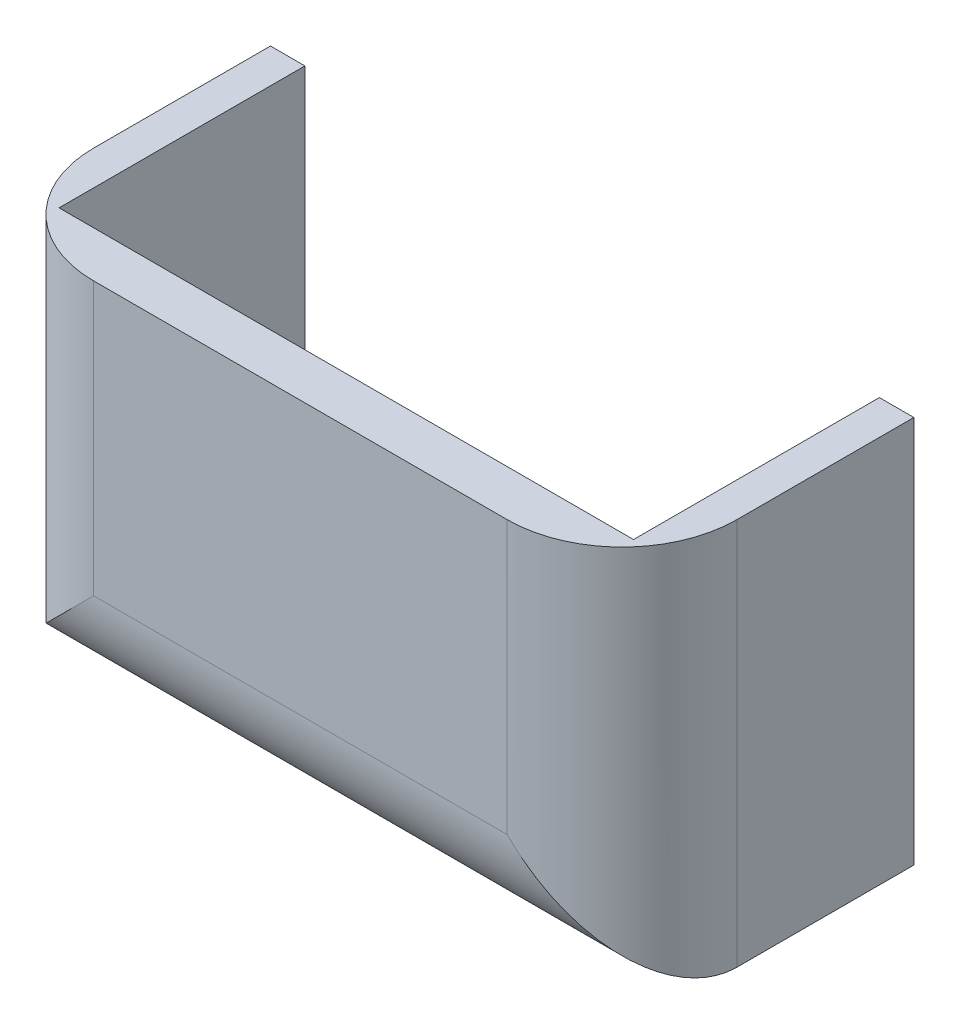
ISO-10303-21;
HEADER;
FILE_DESCRIPTION(('STEP AP214'),'2;1');
FILE_NAME('part.step','',(''),(''),'','','');
FILE_SCHEMA(('AUTOMOTIVE_DESIGN { 1 0 10303 214 1 1 1 1 }'));
ENDSEC;
DATA;
#1=APPLICATION_CONTEXT('core data for automotive mechanical design processes');
#2=APPLICATION_PROTOCOL_DEFINITION('international standard','automotive_design',2000,#1);
#3=PRODUCT_CONTEXT('',#1,'mechanical');
#4=PRODUCT('Part','Part','',(#3));
#5=PRODUCT_RELATED_PRODUCT_CATEGORY('part','',(#4));
#6=PRODUCT_DEFINITION_FORMATION('','',#4);
#7=PRODUCT_DEFINITION_CONTEXT('part definition',#1,'design');
#8=PRODUCT_DEFINITION('design','',#6,#7);
#9=PRODUCT_DEFINITION_SHAPE('','',#8);
#10=(LENGTH_UNIT() NAMED_UNIT(*) SI_UNIT(.MILLI.,.METRE.));
#11=(NAMED_UNIT(*) PLANE_ANGLE_UNIT() SI_UNIT($,.RADIAN.));
#12=(NAMED_UNIT(*) SI_UNIT($,.STERADIAN.) SOLID_ANGLE_UNIT());
#13=UNCERTAINTY_MEASURE_WITH_UNIT(LENGTH_MEASURE(1.E-05),#10,'distance_accuracy_value','');
#14=(GEOMETRIC_REPRESENTATION_CONTEXT(3) GLOBAL_UNCERTAINTY_ASSIGNED_CONTEXT((#13)) GLOBAL_UNIT_ASSIGNED_CONTEXT((#10,
#11,#12)) REPRESENTATION_CONTEXT('',''));
#15=CARTESIAN_POINT('',(0.,0.,0.));
#16=DIRECTION('',(0.,0.,1.));
#17=DIRECTION('',(1.,0.,0.));
#18=AXIS2_PLACEMENT_3D('',#15,#16,#17);
#19=CARTESIAN_POINT('',(-25.,-36.0430371293911,25.4));
#20=DIRECTION('',(1.,0.,0.));
#21=DIRECTION('',(0.,1.,0.));
#22=AXIS2_PLACEMENT_3D('',#19,#20,#21);
#23=PLANE('',#22);
#24=DIRECTION('',(0.,0.,-1.));
#25=VECTOR('',#24,1.);
#26=CARTESIAN_POINT('',(-25.,-36.0430371293911,25.4));
#27=LINE('',#26,#25);
#28=CARTESIAN_POINT('',(-25.,-36.0430371293911,21.4));
#29=VERTEX_POINT('',#28);
#30=CARTESIAN_POINT('',(-25.,-36.0430371293911,0.));
#31=VERTEX_POINT('',#30);
#32=EDGE_CURVE('E216',#29,#31,#27,.T.);
#33=ORIENTED_EDGE('',*,*,#32,.F.);
#34=DIRECTION('',(0.,-1.,0.));
#35=VECTOR('',#34,1.);
#36=CARTESIAN_POINT('',(-25.,-36.0430371293911,21.4));
#37=LINE('',#36,#35);
#38=CARTESIAN_POINT('',(-25.,-66.782740738817,21.4));
#39=VERTEX_POINT('',#38);
#40=EDGE_CURVE('E199',#29,#39,#37,.T.);
#41=ORIENTED_EDGE('',*,*,#40,.T.);
#42=DIRECTION('',(0.,0.,-1.));
#43=VECTOR('',#42,1.);
#44=CARTESIAN_POINT('',(-25.,-66.782740738817,25.4));
#45=LINE('',#44,#43);
#46=CARTESIAN_POINT('',(-25.,-66.782740738817,0.));
#47=VERTEX_POINT('',#46);
#48=EDGE_CURVE('E225',#39,#47,#45,.T.);
#49=ORIENTED_EDGE('',*,*,#48,.T.);
#50=DIRECTION('',(0.,-1.,0.));
#51=VECTOR('',#50,1.);
#52=CARTESIAN_POINT('',(-25.,-36.0430371293911,0.));
#53=LINE('',#52,#51);
#54=EDGE_CURVE('E207',#31,#47,#53,.T.);
#55=ORIENTED_EDGE('',*,*,#54,.F.);
#56=EDGE_LOOP('',(#33,#41,#49,#55));
#57=FACE_BOUND('',#56,.T.);
#58=ADVANCED_FACE('F44',(#57),#23,.T.);
#59=CARTESIAN_POINT('',(-25.,-66.782740738817,25.4));
#60=DIRECTION('',(0.,1.,0.));
#61=DIRECTION('',(0.,0.,1.));
#62=AXIS2_PLACEMENT_3D('',#59,#60,#61);
#63=PLANE('',#62);
#64=ORIENTED_EDGE('',*,*,#48,.F.);
#65=DIRECTION('',(1.,0.,0.));
#66=VECTOR('',#65,1.);
#67=CARTESIAN_POINT('',(-25.,-66.782740738817,21.4));
#68=LINE('',#67,#66);
#69=CARTESIAN_POINT('',(25.,-66.782740738817,21.4));
#70=VERTEX_POINT('',#69);
#71=EDGE_CURVE('E193',#39,#70,#68,.T.);
#72=ORIENTED_EDGE('',*,*,#71,.T.);
#73=DIRECTION('',(0.,0.,-1.));
#74=VECTOR('',#73,1.);
#75=CARTESIAN_POINT('',(25.,-66.782740738817,25.4));
#76=LINE('',#75,#74);
#77=CARTESIAN_POINT('',(25.,-66.782740738817,0.));
#78=VERTEX_POINT('',#77);
#79=EDGE_CURVE('E222',#70,#78,#76,.T.);
#80=ORIENTED_EDGE('',*,*,#79,.T.);
#81=DIRECTION('',(1.,0.,0.));
#82=VECTOR('',#81,1.);
#83=CARTESIAN_POINT('',(-25.,-66.782740738817,0.));
#84=LINE('',#83,#82);
#85=EDGE_CURVE('E211',#47,#78,#84,.T.);
#86=ORIENTED_EDGE('',*,*,#85,.F.);
#87=EDGE_LOOP('',(#64,#72,#80,#86));
#88=FACE_BOUND('',#87,.T.);
#89=ADVANCED_FACE('F257',(#88),#63,.T.);
#90=CARTESIAN_POINT('',(25.,-36.0430371293911,25.4));
#91=DIRECTION('',(-1.,0.,0.));
#92=DIRECTION('',(0.,-1.,0.));
#93=AXIS2_PLACEMENT_3D('',#90,#91,#92);
#94=PLANE('',#93);
#95=ORIENTED_EDGE('',*,*,#79,.F.);
#96=DIRECTION('',(0.,1.,0.));
#97=VECTOR('',#96,1.);
#98=CARTESIAN_POINT('',(25.,-36.0430371293911,21.4));
#99=LINE('',#98,#97);
#100=CARTESIAN_POINT('',(25.,-36.0430371293911,21.4));
#101=VERTEX_POINT('',#100);
#102=EDGE_CURVE('E186',#70,#101,#99,.T.);
#103=ORIENTED_EDGE('',*,*,#102,.T.);
#104=DIRECTION('',(0.,0.,-1.));
#105=VECTOR('',#104,1.);
#106=CARTESIAN_POINT('',(25.,-36.0430371293911,25.4));
#107=LINE('',#106,#105);
#108=CARTESIAN_POINT('',(25.,-36.0430371293911,0.));
#109=VERTEX_POINT('',#108);
#110=EDGE_CURVE('E219',#101,#109,#107,.T.);
#111=ORIENTED_EDGE('',*,*,#110,.T.);
#112=DIRECTION('',(0.,1.,0.));
#113=VECTOR('',#112,1.);
#114=CARTESIAN_POINT('',(25.,-36.0430371293911,0.));
#115=LINE('',#114,#113);
#116=EDGE_CURVE('E138',#78,#109,#115,.T.);
#117=ORIENTED_EDGE('',*,*,#116,.F.);
#118=EDGE_LOOP('',(#95,#103,#111,#117));
#119=FACE_BOUND('',#118,.T.);
#120=ADVANCED_FACE('F258',(#119),#94,.T.);
#121=CARTESIAN_POINT('',(0.,0.,25.4));
#122=DIRECTION('',(0.,0.,1.));
#123=DIRECTION('',(1.,0.,0.));
#124=AXIS2_PLACEMENT_3D('',#121,#122,#123);
#125=PLANE('',#124);
#126=DIRECTION('',(1.,0.,0.));
#127=VECTOR('',#126,1.);
#128=CARTESIAN_POINT('',(0.,-36.0430371293911,25.4));
#129=LINE('',#128,#127);
#130=CARTESIAN_POINT('',(-18.,-36.0430371293911,25.4));
#131=VERTEX_POINT('',#130);
#132=CARTESIAN_POINT('',(18.,-36.0430371293911,25.4));
#133=VERTEX_POINT('',#132);
#134=EDGE_CURVE('E241',#131,#133,#129,.T.);
#135=ORIENTED_EDGE('',*,*,#134,.F.);
#136=DIRECTION('',(0.,-1.,0.));
#137=VECTOR('',#136,1.);
#138=CARTESIAN_POINT('',(-18.,-69.782740738817,25.4));
#139=LINE('',#138,#137);
#140=CARTESIAN_POINT('',(-18.,-59.782740738817,25.4));
#141=VERTEX_POINT('',#140);
#142=EDGE_CURVE('E169',#131,#141,#139,.T.);
#143=ORIENTED_EDGE('',*,*,#142,.T.);
#144=DIRECTION('',(1.,0.,0.));
#145=VECTOR('',#144,1.);
#146=CARTESIAN_POINT('',(28.,-59.782740738817,25.4));
#147=LINE('',#146,#145);
#148=CARTESIAN_POINT('',(18.,-59.782740738817,25.4));
#149=VERTEX_POINT('',#148);
#150=EDGE_CURVE('E162',#141,#149,#147,.T.);
#151=ORIENTED_EDGE('',*,*,#150,.T.);
#152=DIRECTION('',(0.,1.,0.));
#153=VECTOR('',#152,1.);
#154=CARTESIAN_POINT('',(18.,-33.0430371293911,25.4));
#155=LINE('',#154,#153);
#156=EDGE_CURVE('E165',#149,#133,#155,.T.);
#157=ORIENTED_EDGE('',*,*,#156,.T.);
#158=EDGE_LOOP('',(#135,#143,#151,#157));
#159=FACE_BOUND('',#158,.T.);
#160=ADVANCED_FACE('F243',(#159),#125,.T.);
#161=CARTESIAN_POINT('',(0.,0.,0.));
#162=DIRECTION('',(0.,0.,1.));
#163=DIRECTION('',(1.,0.,0.));
#164=AXIS2_PLACEMENT_3D('',#161,#162,#163);
#165=PLANE('',#164);
#166=DIRECTION('',(0.,-1.,0.));
#167=VECTOR('',#166,1.);
#168=CARTESIAN_POINT('',(-28.,-33.0430371293911,0.));
#169=LINE('',#168,#167);
#170=CARTESIAN_POINT('',(-28.,-36.0430371293911,0.));
#171=VERTEX_POINT('',#170);
#172=CARTESIAN_POINT('',(-28.,-69.782740738817,0.));
#173=VERTEX_POINT('',#172);
#174=EDGE_CURVE('E152',#171,#173,#169,.T.);
#175=ORIENTED_EDGE('',*,*,#174,.F.);
#176=DIRECTION('',(-1.,0.,0.));
#177=VECTOR('',#176,1.);
#178=CARTESIAN_POINT('',(28.,-36.0430371293911,0.));
#179=LINE('',#178,#177);
#180=EDGE_CURVE('E140',#31,#171,#179,.T.);
#181=ORIENTED_EDGE('',*,*,#180,.F.);
#182=ORIENTED_EDGE('',*,*,#54,.T.);
#183=ORIENTED_EDGE('',*,*,#85,.T.);
#184=ORIENTED_EDGE('',*,*,#116,.T.);
#185=CARTESIAN_POINT('',(28.,-36.0430371293911,0.));
#186=VERTEX_POINT('',#185);
#187=EDGE_CURVE('E122',#186,#109,#179,.T.);
#188=ORIENTED_EDGE('',*,*,#187,.F.);
#189=DIRECTION('',(0.,1.,0.));
#190=VECTOR('',#189,1.);
#191=CARTESIAN_POINT('',(28.,-33.0430371293911,0.));
#192=LINE('',#191,#190);
#193=CARTESIAN_POINT('',(28.,-69.782740738817,0.));
#194=VERTEX_POINT('',#193);
#195=EDGE_CURVE('E135',#194,#186,#192,.T.);
#196=ORIENTED_EDGE('',*,*,#195,.F.);
#197=DIRECTION('',(1.,0.,0.));
#198=VECTOR('',#197,1.);
#199=CARTESIAN_POINT('',(-28.,-69.782740738817,0.));
#200=LINE('',#199,#198);
#201=EDGE_CURVE('E146',#173,#194,#200,.T.);
#202=ORIENTED_EDGE('',*,*,#201,.F.);
#203=EDGE_LOOP('',(#175,#181,#182,#183,#184,#188,#196,#202));
#204=FACE_BOUND('',#203,.T.);
#205=ADVANCED_FACE('F133',(#204),#165,.F.);
#206=CARTESIAN_POINT('',(-28.,-33.0430371293911,25.4));
#207=DIRECTION('',(1.,0.,0.));
#208=DIRECTION('',(0.,1.,0.));
#209=AXIS2_PLACEMENT_3D('',#206,#207,#208);
#210=PLANE('',#209);
#211=DIRECTION('',(0.,-1.,0.));
#212=VECTOR('',#211,1.);
#213=CARTESIAN_POINT('',(-28.,-33.0430371293911,15.4));
#214=LINE('',#213,#212);
#215=CARTESIAN_POINT('',(-28.,-69.782740738817,15.4));
#216=VERTEX_POINT('',#215);
#217=CARTESIAN_POINT('',(-28.,-36.0430371293911,15.4));
#218=VERTEX_POINT('',#217);
#219=EDGE_CURVE('E172',#216,#218,#214,.F.);
#220=ORIENTED_EDGE('',*,*,#219,.T.);
#221=DIRECTION('',(0.,0.,-1.));
#222=VECTOR('',#221,1.);
#223=CARTESIAN_POINT('',(-28.,-36.0430371293911,28.));
#224=LINE('',#223,#222);
#225=EDGE_CURVE('E59',#218,#171,#224,.T.);
#226=ORIENTED_EDGE('',*,*,#225,.T.);
#227=ORIENTED_EDGE('',*,*,#174,.T.);
#228=DIRECTION('',(0.,0.,-1.));
#229=VECTOR('',#228,1.);
#230=CARTESIAN_POINT('',(-28.,-69.782740738817,25.4));
#231=LINE('',#230,#229);
#232=EDGE_CURVE('E150',#216,#173,#231,.T.);
#233=ORIENTED_EDGE('',*,*,#232,.F.);
#234=EDGE_LOOP('',(#220,#226,#227,#233));
#235=FACE_BOUND('',#234,.T.);
#236=ADVANCED_FACE('F230',(#235),#210,.F.);
#237=CARTESIAN_POINT('',(-28.,-69.782740738817,25.4));
#238=DIRECTION('',(0.,1.,0.));
#239=DIRECTION('',(0.,0.,1.));
#240=AXIS2_PLACEMENT_3D('',#237,#238,#239);
#241=PLANE('',#240);
#242=DIRECTION('',(0.,0.,-1.));
#243=VECTOR('',#242,1.);
#244=CARTESIAN_POINT('',(28.,-69.782740738817,25.4));
#245=LINE('',#244,#243);
#246=CARTESIAN_POINT('',(28.,-69.782740738817,15.4));
#247=VERTEX_POINT('',#246);
#248=EDGE_CURVE('E143',#247,#194,#245,.T.);
#249=ORIENTED_EDGE('',*,*,#248,.F.);
#250=DIRECTION('',(1.,0.,0.));
#251=VECTOR('',#250,1.);
#252=CARTESIAN_POINT('',(-28.,-69.782740738817,15.4));
#253=LINE('',#252,#251);
#254=EDGE_CURVE('E53',#247,#216,#253,.F.);
#255=ORIENTED_EDGE('',*,*,#254,.T.);
#256=ORIENTED_EDGE('',*,*,#232,.T.);
#257=ORIENTED_EDGE('',*,*,#201,.T.);
#258=EDGE_LOOP('',(#249,#255,#256,#257));
#259=FACE_BOUND('',#258,.T.);
#260=ADVANCED_FACE('F234',(#259),#241,.F.);
#261=CARTESIAN_POINT('',(28.,-33.0430371293911,25.4));
#262=DIRECTION('',(-1.,0.,0.));
#263=DIRECTION('',(0.,-1.,0.));
#264=AXIS2_PLACEMENT_3D('',#261,#262,#263);
#265=PLANE('',#264);
#266=ORIENTED_EDGE('',*,*,#195,.T.);
#267=DIRECTION('',(0.,0.,-1.));
#268=VECTOR('',#267,1.);
#269=CARTESIAN_POINT('',(28.,-36.0430371293911,28.));
#270=LINE('',#269,#268);
#271=CARTESIAN_POINT('',(28.,-36.0430371293911,15.4));
#272=VERTEX_POINT('',#271);
#273=EDGE_CURVE('E119',#272,#186,#270,.T.);
#274=ORIENTED_EDGE('',*,*,#273,.F.);
#275=DIRECTION('',(0.,1.,0.));
#276=VECTOR('',#275,1.);
#277=CARTESIAN_POINT('',(28.,-69.782740738817,15.4));
#278=LINE('',#277,#276);
#279=EDGE_CURVE('E67',#272,#247,#278,.F.);
#280=ORIENTED_EDGE('',*,*,#279,.T.);
#281=ORIENTED_EDGE('',*,*,#248,.T.);
#282=EDGE_LOOP('',(#266,#274,#280,#281));
#283=FACE_BOUND('',#282,.T.);
#284=ADVANCED_FACE('F142',(#283),#265,.F.);
#285=CARTESIAN_POINT('',(0.,0.,21.4));
#286=DIRECTION('',(0.,0.,1.));
#287=DIRECTION('',(1.,0.,0.));
#288=AXIS2_PLACEMENT_3D('',#285,#286,#287);
#289=PLANE('',#288);
#290=ORIENTED_EDGE('',*,*,#40,.F.);
#291=DIRECTION('',(-1.,0.,0.));
#292=VECTOR('',#291,1.);
#293=CARTESIAN_POINT('',(-25.,-36.0430371293911,21.4));
#294=LINE('',#293,#292);
#295=EDGE_CURVE('E159',#101,#29,#294,.T.);
#296=ORIENTED_EDGE('',*,*,#295,.F.);
#297=ORIENTED_EDGE('',*,*,#102,.F.);
#298=ORIENTED_EDGE('',*,*,#71,.F.);
#299=EDGE_LOOP('',(#290,#296,#297,#298));
#300=FACE_BOUND('',#299,.T.);
#301=ADVANCED_FACE('F261',(#300),#289,.F.);
#302=CARTESIAN_POINT('',(18.,0.,15.4));
#303=DIRECTION('',(0.,-1.,0.));
#304=DIRECTION('',(1.,0.,0.));
#305=AXIS2_PLACEMENT_3D('',#302,#303,#304);
#306=CYLINDRICAL_SURFACE('',#305,10.);
#307=CARTESIAN_POINT('',(18.,-36.0430371293911,15.4));
#308=DIRECTION('',(0.,-1.,0.));
#309=DIRECTION('',(0.,0.,-1.));
#310=AXIS2_PLACEMENT_3D('',#307,#308,#309);
#311=CIRCLE('',#310,10.);
#312=EDGE_CURVE('E125',#133,#272,#311,.F.);
#313=ORIENTED_EDGE('',*,*,#312,.F.);
#314=ORIENTED_EDGE('',*,*,#156,.F.);
#315=CARTESIAN_POINT('',(18.,-59.782740738817,15.4));
#316=DIRECTION('',(-0.707106781186547,-0.707106781186548,0.));
#317=DIRECTION('',(-0.707106781186548,0.707106781186547,0.));
#318=AXIS2_PLACEMENT_3D('',#315,#316,#317);
#319=ELLIPSE('',#318,14.142135623731,10.);
#320=EDGE_CURVE('E183',#247,#149,#319,.T.);
#321=ORIENTED_EDGE('',*,*,#320,.F.);
#322=ORIENTED_EDGE('',*,*,#279,.F.);
#323=EDGE_LOOP('',(#313,#314,#321,#322));
#324=FACE_BOUND('',#323,.T.);
#325=ADVANCED_FACE('F46',(#324),#306,.T.);
#326=CARTESIAN_POINT('',(0.,-59.782740738817,15.4));
#327=DIRECTION('',(-1.,0.,0.));
#328=DIRECTION('',(0.,0.,1.));
#329=AXIS2_PLACEMENT_3D('',#326,#327,#328);
#330=CYLINDRICAL_SURFACE('',#329,10.);
#331=ORIENTED_EDGE('',*,*,#320,.T.);
#332=ORIENTED_EDGE('',*,*,#150,.F.);
#333=CARTESIAN_POINT('',(-18.,-59.782740738817,15.4));
#334=DIRECTION('',(-0.707106781186547,0.707106781186547,0.));
#335=DIRECTION('',(-0.707106781186547,-0.707106781186548,0.));
#336=AXIS2_PLACEMENT_3D('',#333,#334,#335);
#337=ELLIPSE('',#336,14.1421356237309,10.);
#338=EDGE_CURVE('E180',#216,#141,#337,.T.);
#339=ORIENTED_EDGE('',*,*,#338,.F.);
#340=ORIENTED_EDGE('',*,*,#254,.F.);
#341=EDGE_LOOP('',(#331,#332,#339,#340));
#342=FACE_BOUND('',#341,.T.);
#343=ADVANCED_FACE('F236',(#342),#330,.T.);
#344=CARTESIAN_POINT('',(-18.,0.,15.4));
#345=DIRECTION('',(0.,1.,0.));
#346=DIRECTION('',(-1.,0.,0.));
#347=AXIS2_PLACEMENT_3D('',#344,#345,#346);
#348=CYLINDRICAL_SURFACE('',#347,10.);
#349=CARTESIAN_POINT('',(-18.,-36.0430371293911,15.4));
#350=DIRECTION('',(0.,-1.,0.));
#351=DIRECTION('',(0.,0.,-1.));
#352=AXIS2_PLACEMENT_3D('',#349,#350,#351);
#353=CIRCLE('',#352,10.);
#354=EDGE_CURVE('E11',#218,#131,#353,.F.);
#355=ORIENTED_EDGE('',*,*,#354,.F.);
#356=ORIENTED_EDGE('',*,*,#219,.F.);
#357=ORIENTED_EDGE('',*,*,#338,.T.);
#358=ORIENTED_EDGE('',*,*,#142,.F.);
#359=EDGE_LOOP('',(#355,#356,#357,#358));
#360=FACE_BOUND('',#359,.T.);
#361=ADVANCED_FACE('F239',(#360),#348,.T.);
#362=CARTESIAN_POINT('',(28.,-36.0430371293911,28.));
#363=DIRECTION('',(0.,-1.,0.));
#364=DIRECTION('',(0.,0.,-1.));
#365=AXIS2_PLACEMENT_3D('',#362,#363,#364);
#366=PLANE('',#365);
#367=ORIENTED_EDGE('',*,*,#32,.T.);
#368=ORIENTED_EDGE('',*,*,#180,.T.);
#369=ORIENTED_EDGE('',*,*,#225,.F.);
#370=ORIENTED_EDGE('',*,*,#354,.T.);
#371=ORIENTED_EDGE('',*,*,#134,.T.);
#372=ORIENTED_EDGE('',*,*,#312,.T.);
#373=ORIENTED_EDGE('',*,*,#273,.T.);
#374=ORIENTED_EDGE('',*,*,#187,.T.);
#375=ORIENTED_EDGE('',*,*,#110,.F.);
#376=ORIENTED_EDGE('',*,*,#295,.T.);
#377=EDGE_LOOP('',(#367,#368,#369,#370,#371,#372,#373,#374,#375,#376));
#378=FACE_BOUND('',#377,.T.);
#379=ADVANCED_FACE('F121',(#378),#366,.F.);
#380=CLOSED_SHELL('',(#58,#89,#120,#160,#205,#236,#260,#284,#301,#325,#343,#361,#379));
#381=MANIFOLD_SOLID_BREP('B2',#380);
#382=ADVANCED_BREP_SHAPE_REPRESENTATION('',(#18,#381),#14);
#383=SHAPE_DEFINITION_REPRESENTATION(#9,#382);
ENDSEC;
END-ISO-10303-21;
